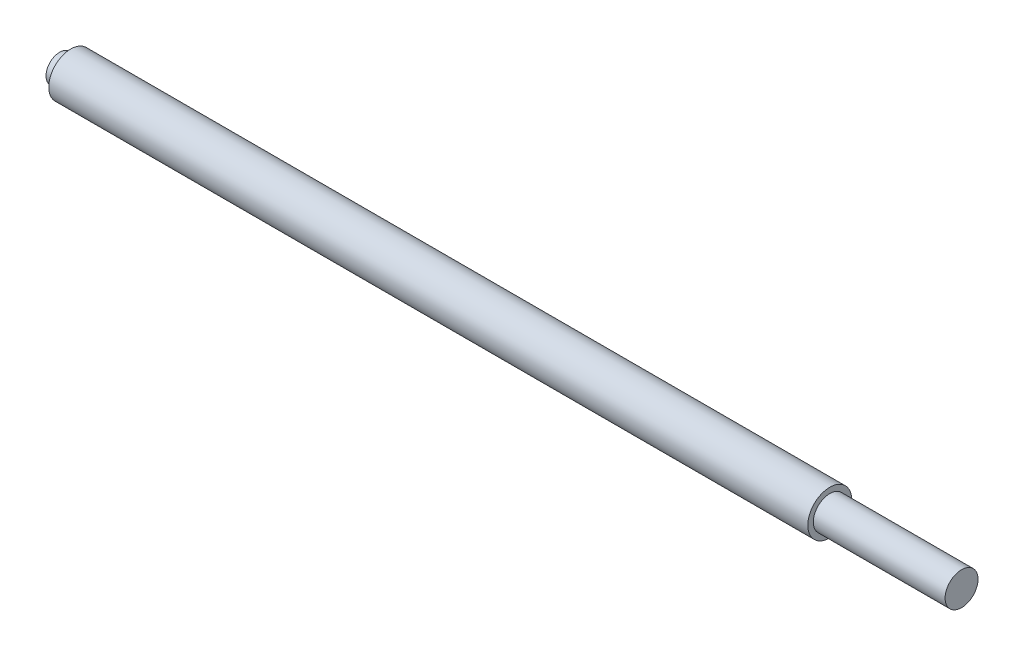
ISO-10303-21;
HEADER;
FILE_DESCRIPTION(('STEP AP214'),'2;1');
FILE_NAME('part.step','',(''),(''),'','','');
FILE_SCHEMA(('AUTOMOTIVE_DESIGN { 1 0 10303 214 1 1 1 1 }'));
ENDSEC;
DATA;
#1=APPLICATION_CONTEXT('core data for automotive mechanical design processes');
#2=APPLICATION_PROTOCOL_DEFINITION('international standard','automotive_design',2000,#1);
#3=PRODUCT_CONTEXT('',#1,'mechanical');
#4=PRODUCT('Part','Part','',(#3));
#5=PRODUCT_RELATED_PRODUCT_CATEGORY('part','',(#4));
#6=PRODUCT_DEFINITION_FORMATION('','',#4);
#7=PRODUCT_DEFINITION_CONTEXT('part definition',#1,'design');
#8=PRODUCT_DEFINITION('design','',#6,#7);
#9=PRODUCT_DEFINITION_SHAPE('','',#8);
#10=(LENGTH_UNIT() NAMED_UNIT(*) SI_UNIT(.MILLI.,.METRE.));
#11=(NAMED_UNIT(*) PLANE_ANGLE_UNIT() SI_UNIT($,.RADIAN.));
#12=(NAMED_UNIT(*) SI_UNIT($,.STERADIAN.) SOLID_ANGLE_UNIT());
#13=UNCERTAINTY_MEASURE_WITH_UNIT(LENGTH_MEASURE(1.E-05),#10,'distance_accuracy_value','');
#14=(GEOMETRIC_REPRESENTATION_CONTEXT(3) GLOBAL_UNCERTAINTY_ASSIGNED_CONTEXT((#13)) GLOBAL_UNIT_ASSIGNED_CONTEXT((#10,
#11,#12)) REPRESENTATION_CONTEXT('',''));
#15=CARTESIAN_POINT('',(0.,0.,0.));
#16=DIRECTION('',(0.,0.,1.));
#17=DIRECTION('',(1.,0.,0.));
#18=AXIS2_PLACEMENT_3D('',#15,#16,#17);
#19=CARTESIAN_POINT('',(6.35,0.,0.));
#20=DIRECTION('',(-1.,0.,0.));
#21=DIRECTION('',(0.,0.,1.));
#22=AXIS2_PLACEMENT_3D('',#19,#20,#21);
#23=PLANE('',#22);
#24=CARTESIAN_POINT('',(6.35,0.,0.));
#25=DIRECTION('',(-1.,0.,0.));
#26=DIRECTION('',(0.,0.,1.));
#27=AXIS2_PLACEMENT_3D('',#24,#25,#26);
#28=CIRCLE('',#27,12.7000000000001);
#29=CARTESIAN_POINT('',(6.35,0.,12.7000000000001));
#30=VERTEX_POINT('',#29);
#31=EDGE_CURVE('E80',#30,#30,#28,.T.);
#32=ORIENTED_EDGE('',*,*,#31,.T.);
#33=EDGE_LOOP('',(#32));
#34=FACE_BOUND('',#33,.T.);
#35=CARTESIAN_POINT('',(6.35,0.,0.));
#36=DIRECTION('',(-1.,0.,0.));
#37=DIRECTION('',(0.,0.,1.));
#38=AXIS2_PLACEMENT_3D('',#35,#36,#37);
#39=CIRCLE('',#38,7.9375);
#40=CARTESIAN_POINT('',(6.35,0.,7.9375));
#41=VERTEX_POINT('',#40);
#42=EDGE_CURVE('E73',#41,#41,#39,.T.);
#43=ORIENTED_EDGE('',*,*,#42,.F.);
#44=EDGE_LOOP('',(#43));
#45=FACE_BOUND('',#44,.T.);
#46=ADVANCED_FACE('F41',(#34,#45),#23,.T.);
#47=CARTESIAN_POINT('',(0.,0.,0.));
#48=DIRECTION('',(-1.,0.,0.));
#49=DIRECTION('',(0.,0.,1.));
#50=AXIS2_PLACEMENT_3D('',#47,#48,#49);
#51=CYLINDRICAL_SURFACE('',#50,7.9375);
#52=ORIENTED_EDGE('',*,*,#42,.T.);
#53=EDGE_LOOP('',(#52));
#54=FACE_BOUND('',#53,.T.);
#55=CARTESIAN_POINT('',(0.,0.,0.));
#56=DIRECTION('',(-1.,0.,0.));
#57=DIRECTION('',(0.,0.,1.));
#58=AXIS2_PLACEMENT_3D('',#55,#56,#57);
#59=CIRCLE('',#58,7.9375);
#60=CARTESIAN_POINT('',(0.,0.,7.9375));
#61=VERTEX_POINT('',#60);
#62=EDGE_CURVE('E94',#61,#61,#59,.T.);
#63=ORIENTED_EDGE('',*,*,#62,.F.);
#64=EDGE_LOOP('',(#63));
#65=FACE_BOUND('',#64,.T.);
#66=ADVANCED_FACE('F101',(#54,#65),#51,.T.);
#67=CARTESIAN_POINT('',(0.,0.,0.));
#68=DIRECTION('',(1.,0.,0.));
#69=DIRECTION('',(0.,0.,-1.));
#70=AXIS2_PLACEMENT_3D('',#67,#68,#69);
#71=PLANE('',#70);
#72=ORIENTED_EDGE('',*,*,#62,.T.);
#73=EDGE_LOOP('',(#72));
#74=FACE_BOUND('',#73,.T.);
#75=ADVANCED_FACE('F109',(#74),#71,.F.);
#76=CARTESIAN_POINT('',(521.426359816927,0.,0.));
#77=DIRECTION('',(-1.,0.,0.));
#78=DIRECTION('',(0.,0.,1.));
#79=AXIS2_PLACEMENT_3D('',#76,#77,#78);
#80=PLANE('',#79);
#81=CARTESIAN_POINT('',(521.426359816927,0.,0.));
#82=DIRECTION('',(-1.,0.,0.));
#83=DIRECTION('',(0.,0.,1.));
#84=AXIS2_PLACEMENT_3D('',#81,#82,#83);
#85=CIRCLE('',#84,9.52500000000001);
#86=CARTESIAN_POINT('',(521.426359816927,0.,9.52499999999994));
#87=VERTEX_POINT('',#86);
#88=EDGE_CURVE('E91',#87,#87,#85,.T.);
#89=ORIENTED_EDGE('',*,*,#88,.F.);
#90=EDGE_LOOP('',(#89));
#91=FACE_BOUND('',#90,.T.);
#92=ADVANCED_FACE('F128',(#91),#80,.F.);
#93=CARTESIAN_POINT('',(0.,0.,0.));
#94=DIRECTION('',(-1.,0.,0.));
#95=DIRECTION('',(0.,0.,1.));
#96=AXIS2_PLACEMENT_3D('',#93,#94,#95);
#97=CYLINDRICAL_SURFACE('',#96,9.52500000000005);
#98=CARTESIAN_POINT('',(445.226359816927,0.,0.));
#99=DIRECTION('',(-1.,0.,0.));
#100=DIRECTION('',(0.,0.,1.));
#101=AXIS2_PLACEMENT_3D('',#98,#99,#100);
#102=CIRCLE('',#101,9.5250000000001);
#103=CARTESIAN_POINT('',(445.226359816927,0.,9.52500000000005));
#104=VERTEX_POINT('',#103);
#105=EDGE_CURVE('E88',#104,#104,#102,.T.);
#106=ORIENTED_EDGE('',*,*,#105,.F.);
#107=EDGE_LOOP('',(#106));
#108=FACE_BOUND('',#107,.T.);
#109=ORIENTED_EDGE('',*,*,#88,.T.);
#110=EDGE_LOOP('',(#109));
#111=FACE_BOUND('',#110,.T.);
#112=ADVANCED_FACE('F121',(#108,#111),#97,.T.);
#113=CARTESIAN_POINT('',(445.226359816927,0.,0.));
#114=DIRECTION('',(-1.,0.,0.));
#115=DIRECTION('',(0.,0.,1.));
#116=AXIS2_PLACEMENT_3D('',#113,#114,#115);
#117=PLANE('',#116);
#118=CARTESIAN_POINT('',(445.226359816927,0.,0.));
#119=DIRECTION('',(-1.,0.,0.));
#120=DIRECTION('',(0.,0.,1.));
#121=AXIS2_PLACEMENT_3D('',#118,#119,#120);
#122=CIRCLE('',#121,12.7);
#123=CARTESIAN_POINT('',(445.226359816927,0.,12.7));
#124=VERTEX_POINT('',#123);
#125=EDGE_CURVE('E85',#124,#124,#122,.T.);
#126=ORIENTED_EDGE('',*,*,#125,.F.);
#127=EDGE_LOOP('',(#126));
#128=FACE_BOUND('',#127,.T.);
#129=ORIENTED_EDGE('',*,*,#105,.T.);
#130=EDGE_LOOP('',(#129));
#131=FACE_BOUND('',#130,.T.);
#132=ADVANCED_FACE('F114',(#128,#131),#117,.F.);
#133=CARTESIAN_POINT('',(0.,0.,0.));
#134=DIRECTION('',(-1.,0.,0.));
#135=DIRECTION('',(0.,0.,1.));
#136=AXIS2_PLACEMENT_3D('',#133,#134,#135);
#137=CYLINDRICAL_SURFACE('',#136,12.7000000000001);
#138=CARTESIAN_POINT('',(196.306359816927,0.,0.));
#139=DIRECTION('',(-1.,0.,0.));
#140=DIRECTION('',(0.,0.,1.));
#141=AXIS2_PLACEMENT_3D('',#138,#139,#140);
#142=CIRCLE('',#141,12.7000000000001);
#143=CARTESIAN_POINT('',(196.306359816927,-8.4002604126301,-9.52500000000008));
#144=VERTEX_POINT('',#143);
#145=CARTESIAN_POINT('',(196.306359816927,8.4002604126301,-9.52500000000008));
#146=VERTEX_POINT('',#145);
#147=EDGE_CURVE('E68',#144,#146,#142,.F.);
#148=ORIENTED_EDGE('',*,*,#147,.F.);
#149=DIRECTION('',(-1.,0.,0.));
#150=VECTOR('',#149,1.);
#151=CARTESIAN_POINT('',(0.,-8.40026041263007,-9.52500000000008));
#152=LINE('',#151,#150);
#153=CARTESIAN_POINT('',(221.706359816927,-8.40026041263007,-9.52500000000008));
#154=VERTEX_POINT('',#153);
#155=EDGE_CURVE('E11',#154,#144,#152,.T.);
#156=ORIENTED_EDGE('',*,*,#155,.F.);
#157=CARTESIAN_POINT('',(221.706359816927,0.,0.));
#158=DIRECTION('',(1.,0.,0.));
#159=DIRECTION('',(0.,0.,-1.));
#160=AXIS2_PLACEMENT_3D('',#157,#158,#159);
#161=CIRCLE('',#160,12.7000000000001);
#162=CARTESIAN_POINT('',(221.706359816927,8.40026041263007,-9.52500000000008));
#163=VERTEX_POINT('',#162);
#164=EDGE_CURVE('E48',#163,#154,#161,.F.);
#165=ORIENTED_EDGE('',*,*,#164,.F.);
#166=DIRECTION('',(-1.,0.,0.));
#167=VECTOR('',#166,1.);
#168=CARTESIAN_POINT('',(0.,8.40026041263007,-9.52500000000008));
#169=LINE('',#168,#167);
#170=EDGE_CURVE('E55',#146,#163,#169,.F.);
#171=ORIENTED_EDGE('',*,*,#170,.F.);
#172=EDGE_LOOP('',(#148,#156,#165,#171));
#173=FACE_BOUND('',#172,.T.);
#174=ORIENTED_EDGE('',*,*,#125,.T.);
#175=EDGE_LOOP('',(#174));
#176=FACE_BOUND('',#175,.T.);
#177=ORIENTED_EDGE('',*,*,#31,.F.);
#178=EDGE_LOOP('',(#177));
#179=FACE_BOUND('',#178,.T.);
#180=ADVANCED_FACE('F69',(#173,#176,#179),#137,.T.);
#181=CARTESIAN_POINT('',(221.706359816927,-12.7000000000001,-9.52500000000008));
#182=DIRECTION('',(1.,0.,0.));
#183=DIRECTION('',(0.,0.,-1.));
#184=AXIS2_PLACEMENT_3D('',#181,#182,#183);
#185=PLANE('',#184);
#186=ORIENTED_EDGE('',*,*,#164,.T.);
#187=DIRECTION('',(0.,1.,0.));
#188=VECTOR('',#187,1.);
#189=CARTESIAN_POINT('',(221.706359816927,-12.7000000000001,-9.52500000000008));
#190=LINE('',#189,#188);
#191=EDGE_CURVE('E77',#154,#163,#190,.T.);
#192=ORIENTED_EDGE('',*,*,#191,.T.);
#193=EDGE_LOOP('',(#186,#192));
#194=FACE_BOUND('',#193,.T.);
#195=ADVANCED_FACE('F113',(#194),#185,.F.);
#196=CARTESIAN_POINT('',(196.306359816927,-12.7000000000001,-9.52500000000008));
#197=DIRECTION('',(0.,0.,1.));
#198=DIRECTION('',(1.,0.,0.));
#199=AXIS2_PLACEMENT_3D('',#196,#197,#198);
#200=PLANE('',#199);
#201=ORIENTED_EDGE('',*,*,#170,.T.);
#202=ORIENTED_EDGE('',*,*,#191,.F.);
#203=ORIENTED_EDGE('',*,*,#155,.T.);
#204=DIRECTION('',(0.,1.,0.));
#205=VECTOR('',#204,1.);
#206=CARTESIAN_POINT('',(196.306359816927,-12.7000000000001,-9.52500000000008));
#207=LINE('',#206,#205);
#208=EDGE_CURVE('E76',#144,#146,#207,.T.);
#209=ORIENTED_EDGE('',*,*,#208,.T.);
#210=EDGE_LOOP('',(#201,#202,#203,#209));
#211=FACE_BOUND('',#210,.T.);
#212=ADVANCED_FACE('F75',(#211),#200,.F.);
#213=CARTESIAN_POINT('',(196.306359816927,-12.7000000000001,-9.52500000000008));
#214=DIRECTION('',(-1.,0.,0.));
#215=DIRECTION('',(0.,0.,1.));
#216=AXIS2_PLACEMENT_3D('',#213,#214,#215);
#217=PLANE('',#216);
#218=ORIENTED_EDGE('',*,*,#208,.F.);
#219=ORIENTED_EDGE('',*,*,#147,.T.);
#220=EDGE_LOOP('',(#218,#219));
#221=FACE_BOUND('',#220,.T.);
#222=ADVANCED_FACE('F78',(#221),#217,.F.);
#223=CLOSED_SHELL('',(#46,#66,#75,#92,#112,#132,#180,#195,#212,#222));
#224=MANIFOLD_SOLID_BREP('B2',#223);
#225=ADVANCED_BREP_SHAPE_REPRESENTATION('',(#18,#224),#14);
#226=SHAPE_DEFINITION_REPRESENTATION(#9,#225);
ENDSEC;
END-ISO-10303-21;
